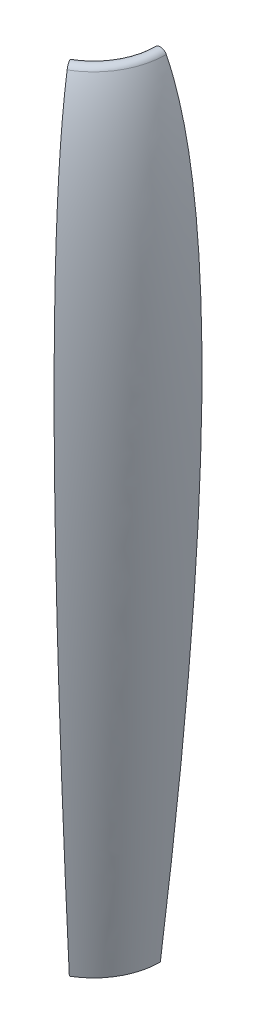
ISO-10303-21;
HEADER;
FILE_DESCRIPTION(('STEP AP214'),'2;1');
FILE_NAME('part.step','',(''),(''),'','','');
FILE_SCHEMA(('AUTOMOTIVE_DESIGN { 1 0 10303 214 1 1 1 1 }'));
ENDSEC;
DATA;
#1=APPLICATION_CONTEXT('core data for automotive mechanical design processes');
#2=APPLICATION_PROTOCOL_DEFINITION('international standard','automotive_design',2000,#1);
#3=PRODUCT_CONTEXT('',#1,'mechanical');
#4=PRODUCT('Part','Part','',(#3));
#5=PRODUCT_RELATED_PRODUCT_CATEGORY('part','',(#4));
#6=PRODUCT_DEFINITION_FORMATION('','',#4);
#7=PRODUCT_DEFINITION_CONTEXT('part definition',#1,'design');
#8=PRODUCT_DEFINITION('design','',#6,#7);
#9=PRODUCT_DEFINITION_SHAPE('','',#8);
#10=(LENGTH_UNIT() NAMED_UNIT(*) SI_UNIT(.MILLI.,.METRE.));
#11=(NAMED_UNIT(*) PLANE_ANGLE_UNIT() SI_UNIT($,.RADIAN.));
#12=(NAMED_UNIT(*) SI_UNIT($,.STERADIAN.) SOLID_ANGLE_UNIT());
#13=UNCERTAINTY_MEASURE_WITH_UNIT(LENGTH_MEASURE(1.E-05),#10,'distance_accuracy_value','');
#14=(GEOMETRIC_REPRESENTATION_CONTEXT(3) GLOBAL_UNCERTAINTY_ASSIGNED_CONTEXT((#13)) GLOBAL_UNIT_ASSIGNED_CONTEXT((#10,
#11,#12)) REPRESENTATION_CONTEXT('',''));
#15=CARTESIAN_POINT('',(0.,0.,0.));
#16=DIRECTION('',(0.,0.,1.));
#17=DIRECTION('',(1.,0.,0.));
#18=AXIS2_PLACEMENT_3D('',#15,#16,#17);
#19=CARTESIAN_POINT('',(-12.7,-152.4,21.9970452561248));
#20=CARTESIAN_POINT('',(2.58622006163685,92.2411110099885,48.4735550585587));
#21=CARTESIAN_POINT('',(-11.566114052826,148.348367023981,23.9609933266187));
#22=B_SPLINE_CURVE_WITH_KNOTS('',2,(#19,#20,#21),.UNSPECIFIED.,.F.,.F.,(3,3),(0.,1.),.UNSPECIFIED.);
#23=CARTESIAN_POINT('',(-25.4,132.199806754471,0.));
#24=DIRECTION('',(0.,1.,0.));
#25=AXIS1_PLACEMENT('',#23,#24);
#26=SURFACE_OF_REVOLUTION('',#22,#25);
#27=CARTESIAN_POINT('',(-25.4,148.348367023981,0.));
#28=DIRECTION('',(0.,1.,0.));
#29=DIRECTION('',(-1.,0.,0.));
#30=AXIS2_PLACEMENT_3D('',#27,#28,#29);
#31=CIRCLE('',#30,27.6677718943482);
#32=CARTESIAN_POINT('',(-11.566114052826,148.348367023981,23.9609933266187));
#33=VERTEX_POINT('',#32);
#34=CARTESIAN_POINT('',(2.26777189434819,148.348367023981,0.));
#35=VERTEX_POINT('',#34);
#36=EDGE_CURVE('E11',#33,#35,#31,.T.);
#37=ORIENTED_EDGE('',*,*,#36,.F.);
#38=CARTESIAN_POINT('',(-12.7,-152.4,21.9970452561248));
#39=VERTEX_POINT('',#38);
#40=EDGE_CURVE('E168',#39,#33,#22,.T.);
#41=ORIENTED_EDGE('',*,*,#40,.F.);
#42=CARTESIAN_POINT('',(-25.4,-152.4,0.));
#43=DIRECTION('',(0.,1.,0.));
#44=DIRECTION('',(-1.,0.,0.));
#45=AXIS2_PLACEMENT_3D('',#42,#43,#44);
#46=CIRCLE('',#45,25.4);
#47=CARTESIAN_POINT('',(0.,-152.4,0.));
#48=VERTEX_POINT('',#47);
#49=EDGE_CURVE('E54',#39,#48,#46,.T.);
#50=ORIENTED_EDGE('',*,*,#49,.T.);
#51=CARTESIAN_POINT('',(0.,-152.4,0.));
#52=CARTESIAN_POINT('',(30.5724401232739,92.2411110099885,0.));
#53=CARTESIAN_POINT('',(2.26777189434819,148.348367023981,0.));
#54=B_SPLINE_CURVE_WITH_KNOTS('',2,(#51,#52,#53),.UNSPECIFIED.,.F.,.F.,(3,3),(0.,1.),.UNSPECIFIED.);
#55=EDGE_CURVE('E135',#48,#35,#54,.T.);
#56=ORIENTED_EDGE('',*,*,#55,.T.);
#57=EDGE_LOOP('',(#37,#41,#50,#56));
#58=FACE_BOUND('',#57,.T.);
#59=ADVANCED_FACE('F38',(#58),#26,.T.);
#60=CARTESIAN_POINT('',(-25.4,147.204334404164,0.));
#61=DIRECTION('',(0.,1.,0.));
#62=DIRECTION('',(-1.,0.,0.));
#63=AXIS2_PLACEMENT_3D('',#60,#61,#62);
#64=TOROIDAL_SURFACE('',#63,25.4,2.53999999999999);
#65=CARTESIAN_POINT('',(-25.4,148.348367023981,0.));
#66=DIRECTION('',(0.,1.,0.));
#67=DIRECTION('',(-1.,0.,0.));
#68=AXIS2_PLACEMENT_3D('',#65,#66,#67);
#69=CIRCLE('',#68,23.1322281056518);
#70=CARTESIAN_POINT('',(-13.8338859471742,148.348367023981,20.0330971856309));
#71=VERTEX_POINT('',#70);
#72=CARTESIAN_POINT('',(-2.26777189434819,148.348367023981,0.));
#73=VERTEX_POINT('',#72);
#74=EDGE_CURVE('E47',#71,#73,#69,.T.);
#75=ORIENTED_EDGE('',*,*,#74,.F.);
#76=CARTESIAN_POINT('',(-12.7000000000001,147.204334404164,21.9970452561248));
#77=DIRECTION('',(-0.86602540378444,0.,0.499999999999998));
#78=DIRECTION('',(-0.499999999999998,0.,-0.86602540378444));
#79=AXIS2_PLACEMENT_3D('',#76,#77,#78);
#80=CIRCLE('',#79,2.53999999999999);
#81=EDGE_CURVE('E175',#33,#71,#80,.T.);
#82=ORIENTED_EDGE('',*,*,#81,.F.);
#83=ORIENTED_EDGE('',*,*,#36,.T.);
#84=CARTESIAN_POINT('',(0.,147.204334404164,0.));
#85=DIRECTION('',(0.,0.,1.));
#86=DIRECTION('',(-1.,0.,0.));
#87=AXIS2_PLACEMENT_3D('',#84,#85,#86);
#88=CIRCLE('',#87,2.53999999999999);
#89=EDGE_CURVE('E141',#35,#73,#88,.T.);
#90=ORIENTED_EDGE('',*,*,#89,.T.);
#91=EDGE_LOOP('',(#75,#82,#83,#90));
#92=FACE_BOUND('',#91,.T.);
#93=ADVANCED_FACE('F40',(#92),#64,.T.);
#94=CARTESIAN_POINT('',(-25.4,57.15,0.));
#95=DIRECTION('',(0.,1.,0.));
#96=DIRECTION('',(-1.,0.,0.));
#97=AXIS2_PLACEMENT_3D('',#94,#95,#96);
#98=TOROIDAL_SURFACE('',#97,25.4,3.80999999999999);
#99=CARTESIAN_POINT('',(-25.4,57.15,0.));
#100=DIRECTION('',(0.,1.,0.));
#101=DIRECTION('',(-1.,0.,0.));
#102=AXIS2_PLACEMENT_3D('',#99,#100,#101);
#103=CIRCLE('',#102,29.21);
#104=CARTESIAN_POINT('',(-10.7950000000001,57.15,25.2966020445435));
#105=VERTEX_POINT('',#104);
#106=CARTESIAN_POINT('',(3.80999999999998,57.15,0.));
#107=VERTEX_POINT('',#106);
#108=EDGE_CURVE('E98',#105,#107,#103,.T.);
#109=ORIENTED_EDGE('',*,*,#108,.F.);
#110=CARTESIAN_POINT('',(-12.7000000000001,57.15,21.9970452561248));
#111=DIRECTION('',(-0.86602540378444,0.,0.499999999999998));
#112=DIRECTION('',(0.499999999999998,0.,0.86602540378444));
#113=AXIS2_PLACEMENT_3D('',#110,#111,#112);
#114=CIRCLE('',#113,3.80999999999999);
#115=CARTESIAN_POINT('',(-14.605,57.15,18.6974884677061));
#116=VERTEX_POINT('',#115);
#117=EDGE_CURVE('E152',#105,#116,#114,.T.);
#118=ORIENTED_EDGE('',*,*,#117,.T.);
#119=CARTESIAN_POINT('',(-25.4,57.15,0.));
#120=DIRECTION('',(0.,1.,0.));
#121=DIRECTION('',(-1.,0.,0.));
#122=AXIS2_PLACEMENT_3D('',#119,#120,#121);
#123=CIRCLE('',#122,21.59);
#124=CARTESIAN_POINT('',(-3.81,57.15,0.));
#125=VERTEX_POINT('',#124);
#126=EDGE_CURVE('E115',#116,#125,#123,.T.);
#127=ORIENTED_EDGE('',*,*,#126,.T.);
#128=CARTESIAN_POINT('',(0.,57.15,0.));
#129=DIRECTION('',(0.,0.,1.));
#130=DIRECTION('',(1.,0.,0.));
#131=AXIS2_PLACEMENT_3D('',#128,#129,#130);
#132=CIRCLE('',#131,3.80999999999999);
#133=EDGE_CURVE('E113',#107,#125,#132,.T.);
#134=ORIENTED_EDGE('',*,*,#133,.F.);
#135=EDGE_LOOP('',(#109,#118,#127,#134));
#136=FACE_BOUND('',#135,.T.);
#137=ADVANCED_FACE('F114',(#136),#98,.F.);
#138=CARTESIAN_POINT('',(-25.4,132.199806754471,0.));
#139=DIRECTION('',(0.,1.,0.));
#140=DIRECTION('',(-1.,0.,0.));
#141=AXIS2_PLACEMENT_3D('',#138,#139,#140);
#142=CYLINDRICAL_SURFACE('',#141,29.21);
#143=CARTESIAN_POINT('',(-25.4,-6.34999999999999,0.));
#144=DIRECTION('',(0.,1.,0.));
#145=DIRECTION('',(-1.,0.,0.));
#146=AXIS2_PLACEMENT_3D('',#143,#144,#145);
#147=CIRCLE('',#146,29.21);
#148=CARTESIAN_POINT('',(-10.7950000000001,-6.35,25.2966020445435));
#149=VERTEX_POINT('',#148);
#150=CARTESIAN_POINT('',(3.81,-6.35,0.));
#151=VERTEX_POINT('',#150);
#152=EDGE_CURVE('E110',#149,#151,#147,.T.);
#153=ORIENTED_EDGE('',*,*,#152,.F.);
#154=DIRECTION('',(0.,1.,0.));
#155=VECTOR('',#154,1.);
#156=CARTESIAN_POINT('',(-10.7950000000001,57.15,25.2966020445435));
#157=LINE('',#156,#155);
#158=EDGE_CURVE('E105',#149,#105,#157,.T.);
#159=ORIENTED_EDGE('',*,*,#158,.T.);
#160=ORIENTED_EDGE('',*,*,#108,.T.);
#161=DIRECTION('',(0.,1.,0.));
#162=VECTOR('',#161,1.);
#163=CARTESIAN_POINT('',(3.80999999999998,57.15,0.));
#164=LINE('',#163,#162);
#165=EDGE_CURVE('E102',#151,#107,#164,.T.);
#166=ORIENTED_EDGE('',*,*,#165,.F.);
#167=EDGE_LOOP('',(#153,#159,#160,#166));
#168=FACE_BOUND('',#167,.T.);
#169=ADVANCED_FACE('F100',(#168),#142,.F.);
#170=CARTESIAN_POINT('',(-25.4,-6.35,0.));
#171=DIRECTION('',(0.,1.,0.));
#172=DIRECTION('',(-1.,0.,0.));
#173=AXIS2_PLACEMENT_3D('',#170,#171,#172);
#174=TOROIDAL_SURFACE('',#173,25.4,3.80999999999999);
#175=CARTESIAN_POINT('',(-25.4,-6.34999999999999,0.));
#176=DIRECTION('',(0.,1.,0.));
#177=DIRECTION('',(-1.,0.,0.));
#178=AXIS2_PLACEMENT_3D('',#175,#176,#177);
#179=CIRCLE('',#178,21.59);
#180=CARTESIAN_POINT('',(-14.605,-6.35,18.6974884677061));
#181=VERTEX_POINT('',#180);
#182=CARTESIAN_POINT('',(-3.80999999999998,-6.35,0.));
#183=VERTEX_POINT('',#182);
#184=EDGE_CURVE('E201',#181,#183,#179,.T.);
#185=ORIENTED_EDGE('',*,*,#184,.F.);
#186=CARTESIAN_POINT('',(-12.7,-6.35,21.9970452561248));
#187=DIRECTION('',(-0.86602540378444,0.,0.499999999999998));
#188=DIRECTION('',(0.499999999999998,0.,0.86602540378444));
#189=AXIS2_PLACEMENT_3D('',#186,#187,#188);
#190=CIRCLE('',#189,3.80999999999999);
#191=EDGE_CURVE('E160',#181,#149,#190,.T.);
#192=ORIENTED_EDGE('',*,*,#191,.T.);
#193=ORIENTED_EDGE('',*,*,#152,.T.);
#194=CARTESIAN_POINT('',(0.,-6.35,0.));
#195=DIRECTION('',(0.,0.,1.));
#196=DIRECTION('',(1.,0.,0.));
#197=AXIS2_PLACEMENT_3D('',#194,#195,#196);
#198=CIRCLE('',#197,3.80999999999999);
#199=EDGE_CURVE('E125',#183,#151,#198,.T.);
#200=ORIENTED_EDGE('',*,*,#199,.F.);
#201=EDGE_LOOP('',(#185,#192,#193,#200));
#202=FACE_BOUND('',#201,.T.);
#203=ADVANCED_FACE('F231',(#202),#174,.F.);
#204=CARTESIAN_POINT('',(-25.4,132.199806754471,0.));
#205=DIRECTION('',(0.,1.,0.));
#206=DIRECTION('',(-1.,0.,0.));
#207=AXIS2_PLACEMENT_3D('',#204,#205,#206);
#208=CYLINDRICAL_SURFACE('',#207,21.59);
#209=DIRECTION('',(0.,-1.,0.));
#210=VECTOR('',#209,1.);
#211=CARTESIAN_POINT('',(-14.605,57.15,18.6974884677061));
#212=LINE('',#211,#210);
#213=EDGE_CURVE('E164',#116,#181,#212,.T.);
#214=ORIENTED_EDGE('',*,*,#213,.T.);
#215=ORIENTED_EDGE('',*,*,#184,.T.);
#216=DIRECTION('',(0.,-1.,0.));
#217=VECTOR('',#216,1.);
#218=CARTESIAN_POINT('',(-3.81,57.15,0.));
#219=LINE('',#218,#217);
#220=EDGE_CURVE('E129',#125,#183,#219,.T.);
#221=ORIENTED_EDGE('',*,*,#220,.F.);
#222=ORIENTED_EDGE('',*,*,#126,.F.);
#223=EDGE_LOOP('',(#214,#215,#221,#222));
#224=FACE_BOUND('',#223,.T.);
#225=ADVANCED_FACE('F188',(#224),#208,.T.);
#226=CARTESIAN_POINT('',(-13.8338859471742,148.348367023981,20.0330971856309));
#227=CARTESIAN_POINT('',(-27.986220061637,92.2411110099885,-4.47946454630913));
#228=CARTESIAN_POINT('',(-12.7,-152.4,21.9970452561248));
#229=B_SPLINE_CURVE_WITH_KNOTS('',2,(#226,#227,#228),.UNSPECIFIED.,.F.,.F.,(3,3),(0.,1.),.UNSPECIFIED.);
#230=CARTESIAN_POINT('',(-25.4,132.199806754471,0.));
#231=DIRECTION('',(0.,1.,0.));
#232=AXIS1_PLACEMENT('',#230,#231);
#233=SURFACE_OF_REVOLUTION('',#229,#232);
#234=EDGE_CURVE('E189',#71,#39,#229,.T.);
#235=ORIENTED_EDGE('',*,*,#234,.F.);
#236=ORIENTED_EDGE('',*,*,#74,.T.);
#237=CARTESIAN_POINT('',(-2.26777189434819,148.348367023981,0.));
#238=CARTESIAN_POINT('',(-30.5724401232739,92.2411110099885,0.));
#239=CARTESIAN_POINT('',(0.,-152.4,0.));
#240=B_SPLINE_CURVE_WITH_KNOTS('',2,(#237,#238,#239),.UNSPECIFIED.,.F.,.F.,(3,3),(0.,1.),.UNSPECIFIED.);
#241=EDGE_CURVE('E147',#73,#48,#240,.T.);
#242=ORIENTED_EDGE('',*,*,#241,.T.);
#243=ORIENTED_EDGE('',*,*,#49,.F.);
#244=EDGE_LOOP('',(#235,#236,#242,#243));
#245=FACE_BOUND('',#244,.T.);
#246=ADVANCED_FACE('F185',(#245),#233,.T.);
#247=CARTESIAN_POINT('',(-4.77341848238808,45.1076472609895,35.7262871749652));
#248=DIRECTION('',(-0.86602540378444,0.,0.499999999999998));
#249=DIRECTION('',(0.499999999999998,0.,0.86602540378444));
#250=AXIS2_PLACEMENT_3D('',#247,#248,#249);
#251=PLANE('',#250);
#252=CARTESIAN_POINT('',(-12.7000000000001,82.55,21.9970452561248));
#253=DIRECTION('',(-0.86602540378444,0.,0.499999999999998));
#254=DIRECTION('',(0.499999999999998,0.,0.86602540378444));
#255=AXIS2_PLACEMENT_3D('',#252,#253,#254);
#256=CIRCLE('',#255,3.175);
#257=CARTESIAN_POINT('',(-11.1125000000001,82.55,24.7466759131404));
#258=VERTEX_POINT('',#257);
#259=EDGE_CURVE('E390',#258,#258,#256,.T.);
#260=ORIENTED_EDGE('',*,*,#259,.F.);
#261=EDGE_LOOP('',(#260));
#262=FACE_BOUND('',#261,.T.);
#263=CARTESIAN_POINT('',(-12.7000000000001,-31.75,21.9970452561248));
#264=DIRECTION('',(-0.86602540378444,0.,0.499999999999998));
#265=DIRECTION('',(0.499999999999998,0.,0.86602540378444));
#266=AXIS2_PLACEMENT_3D('',#263,#264,#265);
#267=CIRCLE('',#266,3.175);
#268=CARTESIAN_POINT('',(-11.1125000000001,-31.75,24.7466759131404));
#269=VERTEX_POINT('',#268);
#270=EDGE_CURVE('E369',#269,#269,#267,.T.);
#271=ORIENTED_EDGE('',*,*,#270,.F.);
#272=EDGE_LOOP('',(#271));
#273=FACE_BOUND('',#272,.T.);
#274=ORIENTED_EDGE('',*,*,#117,.F.);
#275=ORIENTED_EDGE('',*,*,#158,.F.);
#276=ORIENTED_EDGE('',*,*,#191,.F.);
#277=ORIENTED_EDGE('',*,*,#213,.F.);
#278=EDGE_LOOP('',(#274,#275,#276,#277));
#279=FACE_BOUND('',#278,.T.);
#280=ORIENTED_EDGE('',*,*,#40,.T.);
#281=ORIENTED_EDGE('',*,*,#81,.T.);
#282=ORIENTED_EDGE('',*,*,#234,.T.);
#283=EDGE_LOOP('',(#280,#281,#282));
#284=FACE_BOUND('',#283,.T.);
#285=ADVANCED_FACE('F187',(#262,#273,#279,#284),#251,.T.);
#286=CARTESIAN_POINT('',(15.853163035224,45.1076472609895,0.));
#287=DIRECTION('',(0.,0.,1.));
#288=DIRECTION('',(1.,0.,0.));
#289=AXIS2_PLACEMENT_3D('',#286,#287,#288);
#290=PLANE('',#289);
#291=CARTESIAN_POINT('',(0.,82.55,0.));
#292=DIRECTION('',(0.,0.,-1.));
#293=DIRECTION('',(-1.,0.,0.));
#294=AXIS2_PLACEMENT_3D('',#291,#292,#293);
#295=CIRCLE('',#294,3.175);
#296=CARTESIAN_POINT('',(-3.175,82.55,0.));
#297=VERTEX_POINT('',#296);
#298=EDGE_CURVE('E370',#297,#297,#295,.T.);
#299=ORIENTED_EDGE('',*,*,#298,.F.);
#300=EDGE_LOOP('',(#299));
#301=FACE_BOUND('',#300,.T.);
#302=CARTESIAN_POINT('',(0.,-31.75,0.));
#303=DIRECTION('',(0.,0.,-1.));
#304=DIRECTION('',(-1.,0.,0.));
#305=AXIS2_PLACEMENT_3D('',#302,#303,#304);
#306=CIRCLE('',#305,3.175);
#307=CARTESIAN_POINT('',(-3.17500000000002,-31.75,0.));
#308=VERTEX_POINT('',#307);
#309=EDGE_CURVE('E383',#308,#308,#306,.T.);
#310=ORIENTED_EDGE('',*,*,#309,.F.);
#311=EDGE_LOOP('',(#310));
#312=FACE_BOUND('',#311,.T.);
#313=ORIENTED_EDGE('',*,*,#133,.T.);
#314=ORIENTED_EDGE('',*,*,#220,.T.);
#315=ORIENTED_EDGE('',*,*,#199,.T.);
#316=ORIENTED_EDGE('',*,*,#165,.T.);
#317=EDGE_LOOP('',(#313,#314,#315,#316));
#318=FACE_BOUND('',#317,.T.);
#319=ORIENTED_EDGE('',*,*,#55,.F.);
#320=ORIENTED_EDGE('',*,*,#241,.F.);
#321=ORIENTED_EDGE('',*,*,#89,.F.);
#322=EDGE_LOOP('',(#319,#320,#321));
#323=FACE_BOUND('',#322,.T.);
#324=ADVANCED_FACE('F122',(#301,#312,#318,#323),#290,.F.);
#325=CARTESIAN_POINT('',(-1.70147737193768,-31.75,15.6470452561248));
#326=DIRECTION('',(-0.86602540378444,0.,0.499999999999998));
#327=DIRECTION('',(0.499999999999998,0.,0.86602540378444));
#328=AXIS2_PLACEMENT_3D('',#325,#326,#327);
#329=CYLINDRICAL_SURFACE('',#328,3.175);
#330=CARTESIAN_POINT('',(-1.70147737193768,-31.75,15.6470452561248));
#331=DIRECTION('',(-0.86602540378444,0.,0.499999999999998));
#332=DIRECTION('',(0.499999999999998,0.,0.86602540378444));
#333=AXIS2_PLACEMENT_3D('',#330,#331,#332);
#334=CIRCLE('',#333,3.175);
#335=CARTESIAN_POINT('',(-0.113977371937683,-31.75,18.3966759131404));
#336=VERTEX_POINT('',#335);
#337=EDGE_CURVE('E375',#336,#336,#334,.T.);
#338=ORIENTED_EDGE('',*,*,#337,.F.);
#339=EDGE_LOOP('',(#338));
#340=FACE_BOUND('',#339,.T.);
#341=ORIENTED_EDGE('',*,*,#270,.T.);
#342=EDGE_LOOP('',(#341));
#343=FACE_BOUND('',#342,.T.);
#344=ADVANCED_FACE('F221',(#340,#343),#329,.F.);
#345=CARTESIAN_POINT('',(-1.70147737193768,-31.75,15.6470452561248));
#346=DIRECTION('',(-0.86602540378444,0.,0.499999999999998));
#347=DIRECTION('',(0.499999999999998,0.,0.86602540378444));
#348=AXIS2_PLACEMENT_3D('',#345,#346,#347);
#349=PLANE('',#348);
#350=ORIENTED_EDGE('',*,*,#337,.T.);
#351=EDGE_LOOP('',(#350));
#352=FACE_BOUND('',#351,.T.);
#353=ADVANCED_FACE('F293',(#352),#349,.T.);
#354=CARTESIAN_POINT('',(-1.70147737193769,82.55,15.6470452561248));
#355=DIRECTION('',(-0.86602540378444,0.,0.499999999999998));
#356=DIRECTION('',(0.499999999999998,0.,0.86602540378444));
#357=AXIS2_PLACEMENT_3D('',#354,#355,#356);
#358=CYLINDRICAL_SURFACE('',#357,3.175);
#359=CARTESIAN_POINT('',(-1.70147737193769,82.55,15.6470452561248));
#360=DIRECTION('',(-0.86602540378444,0.,0.499999999999998));
#361=DIRECTION('',(0.499999999999998,0.,0.86602540378444));
#362=AXIS2_PLACEMENT_3D('',#359,#360,#361);
#363=CIRCLE('',#362,3.175);
#364=CARTESIAN_POINT('',(-0.113977371937697,82.55,18.3966759131404));
#365=VERTEX_POINT('',#364);
#366=EDGE_CURVE('E120',#365,#365,#363,.T.);
#367=ORIENTED_EDGE('',*,*,#366,.F.);
#368=EDGE_LOOP('',(#367));
#369=FACE_BOUND('',#368,.T.);
#370=ORIENTED_EDGE('',*,*,#259,.T.);
#371=EDGE_LOOP('',(#370));
#372=FACE_BOUND('',#371,.T.);
#373=ADVANCED_FACE('F301',(#369,#372),#358,.F.);
#374=CARTESIAN_POINT('',(-1.70147737193769,82.55,15.6470452561248));
#375=DIRECTION('',(-0.86602540378444,0.,0.499999999999998));
#376=DIRECTION('',(0.499999999999998,0.,0.86602540378444));
#377=AXIS2_PLACEMENT_3D('',#374,#375,#376);
#378=PLANE('',#377);
#379=ORIENTED_EDGE('',*,*,#366,.T.);
#380=EDGE_LOOP('',(#379));
#381=FACE_BOUND('',#380,.T.);
#382=ADVANCED_FACE('F310',(#381),#378,.T.);
#383=CARTESIAN_POINT('',(0.,-31.75,12.7));
#384=DIRECTION('',(0.,0.,-1.));
#385=DIRECTION('',(-1.,0.,0.));
#386=AXIS2_PLACEMENT_3D('',#383,#384,#385);
#387=CYLINDRICAL_SURFACE('',#386,3.175);
#388=CARTESIAN_POINT('',(0.,-31.75,12.7));
#389=DIRECTION('',(0.,0.,-1.));
#390=DIRECTION('',(-1.,0.,0.));
#391=AXIS2_PLACEMENT_3D('',#388,#389,#390);
#392=CIRCLE('',#391,3.175);
#393=CARTESIAN_POINT('',(-3.17500000000002,-31.75,12.7));
#394=VERTEX_POINT('',#393);
#395=EDGE_CURVE('E377',#394,#394,#392,.T.);
#396=ORIENTED_EDGE('',*,*,#395,.F.);
#397=EDGE_LOOP('',(#396));
#398=FACE_BOUND('',#397,.T.);
#399=ORIENTED_EDGE('',*,*,#309,.T.);
#400=EDGE_LOOP('',(#399));
#401=FACE_BOUND('',#400,.T.);
#402=ADVANCED_FACE('F319',(#398,#401),#387,.F.);
#403=CARTESIAN_POINT('',(0.,-31.75,12.7));
#404=DIRECTION('',(0.,0.,-1.));
#405=DIRECTION('',(-1.,0.,0.));
#406=AXIS2_PLACEMENT_3D('',#403,#404,#405);
#407=PLANE('',#406);
#408=ORIENTED_EDGE('',*,*,#395,.T.);
#409=EDGE_LOOP('',(#408));
#410=FACE_BOUND('',#409,.T.);
#411=ADVANCED_FACE('F328',(#410),#407,.T.);
#412=CARTESIAN_POINT('',(0.,82.55,12.7));
#413=DIRECTION('',(0.,0.,-1.));
#414=DIRECTION('',(-1.,0.,0.));
#415=AXIS2_PLACEMENT_3D('',#412,#413,#414);
#416=CYLINDRICAL_SURFACE('',#415,3.175);
#417=CARTESIAN_POINT('',(0.,82.55,12.7));
#418=DIRECTION('',(0.,0.,-1.));
#419=DIRECTION('',(-1.,0.,0.));
#420=AXIS2_PLACEMENT_3D('',#417,#418,#419);
#421=CIRCLE('',#420,3.175);
#422=CARTESIAN_POINT('',(-3.175,82.55,12.7));
#423=VERTEX_POINT('',#422);
#424=EDGE_CURVE('E367',#423,#423,#421,.T.);
#425=ORIENTED_EDGE('',*,*,#424,.F.);
#426=EDGE_LOOP('',(#425));
#427=FACE_BOUND('',#426,.T.);
#428=ORIENTED_EDGE('',*,*,#298,.T.);
#429=EDGE_LOOP('',(#428));
#430=FACE_BOUND('',#429,.T.);
#431=ADVANCED_FACE('F337',(#427,#430),#416,.F.);
#432=CARTESIAN_POINT('',(0.,82.55,12.7));
#433=DIRECTION('',(0.,0.,-1.));
#434=DIRECTION('',(-1.,0.,0.));
#435=AXIS2_PLACEMENT_3D('',#432,#433,#434);
#436=PLANE('',#435);
#437=ORIENTED_EDGE('',*,*,#424,.T.);
#438=EDGE_LOOP('',(#437));
#439=FACE_BOUND('',#438,.T.);
#440=ADVANCED_FACE('F346',(#439),#436,.T.);
#441=CLOSED_SHELL('',(#59,#93,#137,#169,#203,#225,#246,#285,#324,#344,#353,#373,#382,#402,#411,
#431,#440));
#442=MANIFOLD_SOLID_BREP('B2',#441);
#443=ADVANCED_BREP_SHAPE_REPRESENTATION('',(#18,#442),#14);
#444=SHAPE_DEFINITION_REPRESENTATION(#9,#443);
ENDSEC;
END-ISO-10303-21;
